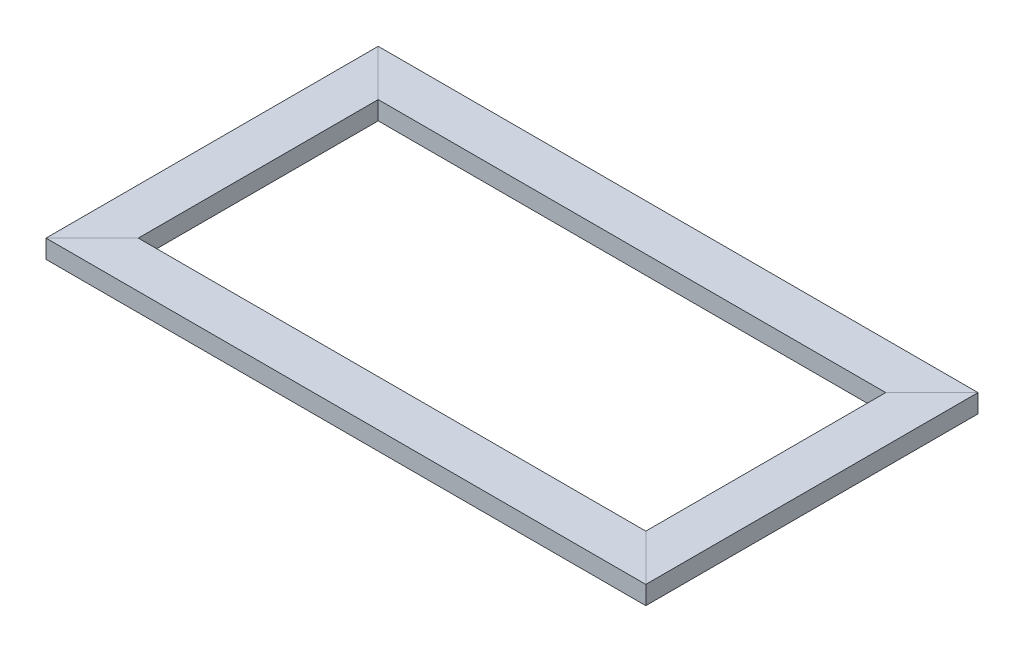
ISO-10303-21;
HEADER;
FILE_DESCRIPTION(('STEP AP214'),'2;1');
FILE_NAME('part.step','',(''),(''),'','','');
FILE_SCHEMA(('AUTOMOTIVE_DESIGN { 1 0 10303 214 1 1 1 1 }'));
ENDSEC;
DATA;
#1=APPLICATION_CONTEXT('core data for automotive mechanical design processes');
#2=APPLICATION_PROTOCOL_DEFINITION('international standard','automotive_design',2000,#1);
#3=PRODUCT_CONTEXT('',#1,'mechanical');
#4=PRODUCT('Part','Part','',(#3));
#5=PRODUCT_RELATED_PRODUCT_CATEGORY('part','',(#4));
#6=PRODUCT_DEFINITION_FORMATION('','',#4);
#7=PRODUCT_DEFINITION_CONTEXT('part definition',#1,'design');
#8=PRODUCT_DEFINITION('design','',#6,#7);
#9=PRODUCT_DEFINITION_SHAPE('','',#8);
#10=(LENGTH_UNIT() NAMED_UNIT(*) SI_UNIT(.MILLI.,.METRE.));
#11=(NAMED_UNIT(*) PLANE_ANGLE_UNIT() SI_UNIT($,.RADIAN.));
#12=(NAMED_UNIT(*) SI_UNIT($,.STERADIAN.) SOLID_ANGLE_UNIT());
#13=UNCERTAINTY_MEASURE_WITH_UNIT(LENGTH_MEASURE(1.E-05),#10,'distance_accuracy_value','');
#14=(GEOMETRIC_REPRESENTATION_CONTEXT(3) GLOBAL_UNCERTAINTY_ASSIGNED_CONTEXT((#13)) GLOBAL_UNIT_ASSIGNED_CONTEXT((#10,
#11,#12)) REPRESENTATION_CONTEXT('',''));
#15=CARTESIAN_POINT('',(0.,0.,0.));
#16=DIRECTION('',(0.,0.,1.));
#17=DIRECTION('',(1.,0.,0.));
#18=AXIS2_PLACEMENT_3D('',#15,#16,#17);
#19=CARTESIAN_POINT('',(650.,0.,-360.));
#20=DIRECTION('',(0.,0.,-1.));
#21=DIRECTION('',(0.,1.,0.));
#22=AXIS2_PLACEMENT_3D('',#19,#20,#21);
#23=PLANE('',#22);
#24=DIRECTION('',(-1.,0.,0.));
#25=VECTOR('',#24,1.);
#26=CARTESIAN_POINT('',(650.,0.,-360.));
#27=LINE('',#26,#25);
#28=CARTESIAN_POINT('',(650.,0.,-360.));
#29=VERTEX_POINT('',#28);
#30=CARTESIAN_POINT('',(0.,0.,-360.));
#31=VERTEX_POINT('',#30);
#32=EDGE_CURVE('E146',#29,#31,#27,.T.);
#33=ORIENTED_EDGE('',*,*,#32,.T.);
#34=DIRECTION('',(0.,-1.,0.));
#35=VECTOR('',#34,1.);
#36=CARTESIAN_POINT('',(1.66533453693773E-13,0.,-360.));
#37=LINE('',#36,#35);
#38=CARTESIAN_POINT('',(0.,20.,-360.));
#39=VERTEX_POINT('',#38);
#40=EDGE_CURVE('E140',#39,#31,#37,.T.);
#41=ORIENTED_EDGE('',*,*,#40,.F.);
#42=DIRECTION('',(-1.,0.,0.));
#43=VECTOR('',#42,1.);
#44=CARTESIAN_POINT('',(650.,20.,-360.));
#45=LINE('',#44,#43);
#46=CARTESIAN_POINT('',(650.,20.,-360.));
#47=VERTEX_POINT('',#46);
#48=EDGE_CURVE('E101',#47,#39,#45,.T.);
#49=ORIENTED_EDGE('',*,*,#48,.F.);
#50=DIRECTION('',(0.,-1.,0.));
#51=VECTOR('',#50,1.);
#52=CARTESIAN_POINT('',(650.,0.,-360.));
#53=LINE('',#52,#51);
#54=EDGE_CURVE('E170',#47,#29,#53,.T.);
#55=ORIENTED_EDGE('',*,*,#54,.T.);
#56=EDGE_LOOP('',(#33,#41,#49,#55));
#57=FACE_BOUND('',#56,.T.);
#58=ADVANCED_FACE('F39',(#57),#23,.T.);
#59=CARTESIAN_POINT('',(650.,0.,-310.));
#60=DIRECTION('',(0.,0.,1.));
#61=DIRECTION('',(0.,-1.,0.));
#62=AXIS2_PLACEMENT_3D('',#59,#60,#61);
#63=PLANE('',#62);
#64=DIRECTION('',(-1.,0.,0.));
#65=VECTOR('',#64,1.);
#66=CARTESIAN_POINT('',(650.,20.,-310.));
#67=LINE('',#66,#65);
#68=CARTESIAN_POINT('',(600.,20.,-310.));
#69=VERTEX_POINT('',#68);
#70=CARTESIAN_POINT('',(50.0000000000002,20.,-310.));
#71=VERTEX_POINT('',#70);
#72=EDGE_CURVE('E43',#69,#71,#67,.T.);
#73=ORIENTED_EDGE('',*,*,#72,.T.);
#74=DIRECTION('',(0.,-1.,0.));
#75=VECTOR('',#74,1.);
#76=CARTESIAN_POINT('',(50.0000000000002,0.,-310.));
#77=LINE('',#76,#75);
#78=CARTESIAN_POINT('',(50.0000000000002,0.,-310.));
#79=VERTEX_POINT('',#78);
#80=EDGE_CURVE('E108',#71,#79,#77,.T.);
#81=ORIENTED_EDGE('',*,*,#80,.T.);
#82=DIRECTION('',(-1.,0.,0.));
#83=VECTOR('',#82,1.);
#84=CARTESIAN_POINT('',(650.,0.,-310.));
#85=LINE('',#84,#83);
#86=CARTESIAN_POINT('',(600.,0.,-310.));
#87=VERTEX_POINT('',#86);
#88=EDGE_CURVE('E117',#87,#79,#85,.T.);
#89=ORIENTED_EDGE('',*,*,#88,.F.);
#90=DIRECTION('',(0.,-1.,0.));
#91=VECTOR('',#90,1.);
#92=CARTESIAN_POINT('',(600.,0.,-310.));
#93=LINE('',#92,#91);
#94=EDGE_CURVE('E115',#69,#87,#93,.T.);
#95=ORIENTED_EDGE('',*,*,#94,.F.);
#96=EDGE_LOOP('',(#73,#81,#89,#95));
#97=FACE_BOUND('',#96,.T.);
#98=ADVANCED_FACE('F112',(#97),#63,.T.);
#99=CARTESIAN_POINT('',(650.,20.,-360.));
#100=DIRECTION('',(0.,1.,0.));
#101=DIRECTION('',(0.,0.,1.));
#102=AXIS2_PLACEMENT_3D('',#99,#100,#101);
#103=PLANE('',#102);
#104=ORIENTED_EDGE('',*,*,#48,.T.);
#105=DIRECTION('',(0.707106781186548,0.,0.707106781186548));
#106=VECTOR('',#105,1.);
#107=CARTESIAN_POINT('',(1.68570504622113E-13,20.,-360.));
#108=LINE('',#107,#106);
#109=EDGE_CURVE('E96',#39,#71,#108,.T.);
#110=ORIENTED_EDGE('',*,*,#109,.T.);
#111=ORIENTED_EDGE('',*,*,#72,.F.);
#112=DIRECTION('',(-0.707106781186548,0.,0.707106781186548));
#113=VECTOR('',#112,1.);
#114=CARTESIAN_POINT('',(470.,20.,-180.));
#115=LINE('',#114,#113);
#116=EDGE_CURVE('E181',#47,#69,#115,.T.);
#117=ORIENTED_EDGE('',*,*,#116,.F.);
#118=EDGE_LOOP('',(#104,#110,#111,#117));
#119=FACE_BOUND('',#118,.T.);
#120=ADVANCED_FACE('F98',(#119),#103,.T.);
#121=CARTESIAN_POINT('',(650.,0.,-360.));
#122=DIRECTION('',(0.,-1.,0.));
#123=DIRECTION('',(0.,0.,-1.));
#124=AXIS2_PLACEMENT_3D('',#121,#122,#123);
#125=PLANE('',#124);
#126=ORIENTED_EDGE('',*,*,#88,.T.);
#127=DIRECTION('',(-0.707106781186548,0.,-0.707106781186548));
#128=VECTOR('',#127,1.);
#129=CARTESIAN_POINT('',(1.66533453693773E-13,0.,-360.));
#130=LINE('',#129,#128);
#131=EDGE_CURVE('E89',#79,#31,#130,.T.);
#132=ORIENTED_EDGE('',*,*,#131,.T.);
#133=ORIENTED_EDGE('',*,*,#32,.F.);
#134=DIRECTION('',(0.707106781186548,0.,-0.707106781186548));
#135=VECTOR('',#134,1.);
#136=CARTESIAN_POINT('',(470.,0.,-180.));
#137=LINE('',#136,#135);
#138=EDGE_CURVE('E107',#87,#29,#137,.T.);
#139=ORIENTED_EDGE('',*,*,#138,.F.);
#140=EDGE_LOOP('',(#126,#132,#133,#139));
#141=FACE_BOUND('',#140,.T.);
#142=ADVANCED_FACE('F41',(#141),#125,.T.);
#143=CARTESIAN_POINT('',(1.66533453693773E-13,0.,-360.));
#144=DIRECTION('',(-1.,0.,0.));
#145=DIRECTION('',(0.,-1.,0.));
#146=AXIS2_PLACEMENT_3D('',#143,#144,#145);
#147=PLANE('',#146);
#148=DIRECTION('',(0.,0.,1.));
#149=VECTOR('',#148,1.);
#150=CARTESIAN_POINT('',(1.66533453693773E-13,0.,-360.));
#151=LINE('',#150,#149);
#152=CARTESIAN_POINT('',(0.,0.,0.));
#153=VERTEX_POINT('',#152);
#154=EDGE_CURVE('E138',#31,#153,#151,.T.);
#155=ORIENTED_EDGE('',*,*,#154,.T.);
#156=DIRECTION('',(0.,-1.,0.));
#157=VECTOR('',#156,1.);
#158=CARTESIAN_POINT('',(0.,0.,0.));
#159=LINE('',#158,#157);
#160=CARTESIAN_POINT('',(0.,20.,0.));
#161=VERTEX_POINT('',#160);
#162=EDGE_CURVE('E220',#161,#153,#159,.T.);
#163=ORIENTED_EDGE('',*,*,#162,.F.);
#164=DIRECTION('',(0.,0.,1.));
#165=VECTOR('',#164,1.);
#166=CARTESIAN_POINT('',(1.68570504622113E-13,20.,-360.));
#167=LINE('',#166,#165);
#168=EDGE_CURVE('E134',#39,#161,#167,.T.);
#169=ORIENTED_EDGE('',*,*,#168,.F.);
#170=ORIENTED_EDGE('',*,*,#40,.T.);
#171=EDGE_LOOP('',(#155,#163,#169,#170));
#172=FACE_BOUND('',#171,.T.);
#173=ADVANCED_FACE('F164',(#172),#147,.T.);
#174=CARTESIAN_POINT('',(50.0000000000002,0.,-360.));
#175=DIRECTION('',(1.,0.,0.));
#176=DIRECTION('',(0.,1.,0.));
#177=AXIS2_PLACEMENT_3D('',#174,#175,#176);
#178=PLANE('',#177);
#179=DIRECTION('',(0.,0.,1.));
#180=VECTOR('',#179,1.);
#181=CARTESIAN_POINT('',(50.0000000000002,20.,-360.));
#182=LINE('',#181,#180);
#183=CARTESIAN_POINT('',(50.0000000000001,20.,-50.0000000000001));
#184=VERTEX_POINT('',#183);
#185=EDGE_CURVE('E123',#71,#184,#182,.T.);
#186=ORIENTED_EDGE('',*,*,#185,.T.);
#187=DIRECTION('',(0.,-1.,0.));
#188=VECTOR('',#187,1.);
#189=CARTESIAN_POINT('',(50.,0.,-50.));
#190=LINE('',#189,#188);
#191=CARTESIAN_POINT('',(50.0000000000001,0.,-50.0000000000001));
#192=VERTEX_POINT('',#191);
#193=EDGE_CURVE('E192',#184,#192,#190,.T.);
#194=ORIENTED_EDGE('',*,*,#193,.T.);
#195=DIRECTION('',(0.,0.,1.));
#196=VECTOR('',#195,1.);
#197=CARTESIAN_POINT('',(50.0000000000002,0.,-360.));
#198=LINE('',#197,#196);
#199=EDGE_CURVE('E126',#79,#192,#198,.T.);
#200=ORIENTED_EDGE('',*,*,#199,.F.);
#201=ORIENTED_EDGE('',*,*,#80,.F.);
#202=EDGE_LOOP('',(#186,#194,#200,#201));
#203=FACE_BOUND('',#202,.T.);
#204=ADVANCED_FACE('F121',(#203),#178,.T.);
#205=CARTESIAN_POINT('',(1.68570504622113E-13,20.,-360.));
#206=DIRECTION('',(0.,1.,0.));
#207=DIRECTION('',(-1.,0.,0.));
#208=AXIS2_PLACEMENT_3D('',#205,#206,#207);
#209=PLANE('',#208);
#210=ORIENTED_EDGE('',*,*,#168,.T.);
#211=DIRECTION('',(0.707106781186548,0.,-0.707106781186548));
#212=VECTOR('',#211,1.);
#213=CARTESIAN_POINT('',(0.,20.,0.));
#214=LINE('',#213,#212);
#215=EDGE_CURVE('E132',#161,#184,#214,.T.);
#216=ORIENTED_EDGE('',*,*,#215,.T.);
#217=ORIENTED_EDGE('',*,*,#185,.F.);
#218=ORIENTED_EDGE('',*,*,#109,.F.);
#219=EDGE_LOOP('',(#210,#216,#217,#218));
#220=FACE_BOUND('',#219,.T.);
#221=ADVANCED_FACE('F130',(#220),#209,.T.);
#222=CARTESIAN_POINT('',(1.66533453693773E-13,0.,-360.));
#223=DIRECTION('',(0.,-1.,0.));
#224=DIRECTION('',(1.,0.,0.));
#225=AXIS2_PLACEMENT_3D('',#222,#223,#224);
#226=PLANE('',#225);
#227=ORIENTED_EDGE('',*,*,#199,.T.);
#228=DIRECTION('',(-0.707106781186548,0.,0.707106781186548));
#229=VECTOR('',#228,1.);
#230=CARTESIAN_POINT('',(0.,0.,0.));
#231=LINE('',#230,#229);
#232=EDGE_CURVE('E222',#192,#153,#231,.T.);
#233=ORIENTED_EDGE('',*,*,#232,.T.);
#234=ORIENTED_EDGE('',*,*,#154,.F.);
#235=ORIENTED_EDGE('',*,*,#131,.F.);
#236=EDGE_LOOP('',(#227,#233,#234,#235));
#237=FACE_BOUND('',#236,.T.);
#238=ADVANCED_FACE('F152',(#237),#226,.T.);
#239=CARTESIAN_POINT('',(650.,0.,0.));
#240=DIRECTION('',(1.,0.,0.));
#241=DIRECTION('',(0.,1.,0.));
#242=AXIS2_PLACEMENT_3D('',#239,#240,#241);
#243=PLANE('',#242);
#244=DIRECTION('',(0.,0.,-1.));
#245=VECTOR('',#244,1.);
#246=CARTESIAN_POINT('',(650.,0.,0.));
#247=LINE('',#246,#245);
#248=CARTESIAN_POINT('',(650.,0.,0.));
#249=VERTEX_POINT('',#248);
#250=EDGE_CURVE('E177',#249,#29,#247,.T.);
#251=ORIENTED_EDGE('',*,*,#250,.T.);
#252=ORIENTED_EDGE('',*,*,#54,.F.);
#253=DIRECTION('',(0.,0.,-1.));
#254=VECTOR('',#253,1.);
#255=CARTESIAN_POINT('',(650.,20.,0.));
#256=LINE('',#255,#254);
#257=CARTESIAN_POINT('',(650.,20.,0.));
#258=VERTEX_POINT('',#257);
#259=EDGE_CURVE('E194',#258,#47,#256,.T.);
#260=ORIENTED_EDGE('',*,*,#259,.F.);
#261=DIRECTION('',(0.,-1.,0.));
#262=VECTOR('',#261,1.);
#263=CARTESIAN_POINT('',(650.,0.,0.));
#264=LINE('',#263,#262);
#265=EDGE_CURVE('E187',#258,#249,#264,.T.);
#266=ORIENTED_EDGE('',*,*,#265,.T.);
#267=EDGE_LOOP('',(#251,#252,#260,#266));
#268=FACE_BOUND('',#267,.T.);
#269=ADVANCED_FACE('F185',(#268),#243,.T.);
#270=CARTESIAN_POINT('',(600.,0.,0.));
#271=DIRECTION('',(-1.,0.,0.));
#272=DIRECTION('',(0.,-1.,0.));
#273=AXIS2_PLACEMENT_3D('',#270,#271,#272);
#274=PLANE('',#273);
#275=DIRECTION('',(0.,0.,-1.));
#276=VECTOR('',#275,1.);
#277=CARTESIAN_POINT('',(600.,20.,0.));
#278=LINE('',#277,#276);
#279=CARTESIAN_POINT('',(600.,20.,-50.0000000000001));
#280=VERTEX_POINT('',#279);
#281=EDGE_CURVE('E204',#280,#69,#278,.T.);
#282=ORIENTED_EDGE('',*,*,#281,.T.);
#283=ORIENTED_EDGE('',*,*,#94,.T.);
#284=DIRECTION('',(0.,0.,-1.));
#285=VECTOR('',#284,1.);
#286=CARTESIAN_POINT('',(600.,0.,0.));
#287=LINE('',#286,#285);
#288=CARTESIAN_POINT('',(600.,0.,-50.0000000000001));
#289=VERTEX_POINT('',#288);
#290=EDGE_CURVE('E179',#289,#87,#287,.T.);
#291=ORIENTED_EDGE('',*,*,#290,.F.);
#292=DIRECTION('',(0.,-1.,0.));
#293=VECTOR('',#292,1.);
#294=CARTESIAN_POINT('',(600.,0.,-50.));
#295=LINE('',#294,#293);
#296=EDGE_CURVE('E230',#280,#289,#295,.T.);
#297=ORIENTED_EDGE('',*,*,#296,.F.);
#298=EDGE_LOOP('',(#282,#283,#291,#297));
#299=FACE_BOUND('',#298,.T.);
#300=ADVANCED_FACE('F278',(#299),#274,.T.);
#301=CARTESIAN_POINT('',(650.,20.,0.));
#302=DIRECTION('',(0.,1.,0.));
#303=DIRECTION('',(0.,0.,1.));
#304=AXIS2_PLACEMENT_3D('',#301,#302,#303);
#305=PLANE('',#304);
#306=ORIENTED_EDGE('',*,*,#259,.T.);
#307=ORIENTED_EDGE('',*,*,#116,.T.);
#308=ORIENTED_EDGE('',*,*,#281,.F.);
#309=DIRECTION('',(-0.707106781186548,0.,-0.707106781186548));
#310=VECTOR('',#309,1.);
#311=CARTESIAN_POINT('',(325.,20.,-325.));
#312=LINE('',#311,#310);
#313=EDGE_CURVE('E50',#258,#280,#312,.T.);
#314=ORIENTED_EDGE('',*,*,#313,.F.);
#315=EDGE_LOOP('',(#306,#307,#308,#314));
#316=FACE_BOUND('',#315,.T.);
#317=ADVANCED_FACE('F267',(#316),#305,.T.);
#318=CARTESIAN_POINT('',(650.,0.,0.));
#319=DIRECTION('',(0.,-1.,0.));
#320=DIRECTION('',(0.,0.,-1.));
#321=AXIS2_PLACEMENT_3D('',#318,#319,#320);
#322=PLANE('',#321);
#323=ORIENTED_EDGE('',*,*,#290,.T.);
#324=ORIENTED_EDGE('',*,*,#138,.T.);
#325=ORIENTED_EDGE('',*,*,#250,.F.);
#326=DIRECTION('',(0.707106781186548,0.,0.707106781186548));
#327=VECTOR('',#326,1.);
#328=CARTESIAN_POINT('',(325.,0.,-325.));
#329=LINE('',#328,#327);
#330=EDGE_CURVE('E11',#289,#249,#329,.T.);
#331=ORIENTED_EDGE('',*,*,#330,.F.);
#332=EDGE_LOOP('',(#323,#324,#325,#331));
#333=FACE_BOUND('',#332,.T.);
#334=ADVANCED_FACE('F175',(#333),#322,.T.);
#335=CARTESIAN_POINT('',(0.,0.,0.));
#336=DIRECTION('',(0.,0.,1.));
#337=DIRECTION('',(1.,0.,0.));
#338=AXIS2_PLACEMENT_3D('',#335,#336,#337);
#339=PLANE('',#338);
#340=DIRECTION('',(1.,0.,0.));
#341=VECTOR('',#340,1.);
#342=CARTESIAN_POINT('',(0.,0.,0.));
#343=LINE('',#342,#341);
#344=EDGE_CURVE('E226',#153,#249,#343,.T.);
#345=ORIENTED_EDGE('',*,*,#344,.T.);
#346=ORIENTED_EDGE('',*,*,#265,.F.);
#347=DIRECTION('',(1.,0.,0.));
#348=VECTOR('',#347,1.);
#349=CARTESIAN_POINT('',(0.,20.,0.));
#350=LINE('',#349,#348);
#351=EDGE_CURVE('E215',#161,#258,#350,.T.);
#352=ORIENTED_EDGE('',*,*,#351,.F.);
#353=ORIENTED_EDGE('',*,*,#162,.T.);
#354=EDGE_LOOP('',(#345,#346,#352,#353));
#355=FACE_BOUND('',#354,.T.);
#356=ADVANCED_FACE('F259',(#355),#339,.T.);
#357=CARTESIAN_POINT('',(0.,0.,-50.));
#358=DIRECTION('',(0.,0.,-1.));
#359=DIRECTION('',(-1.,0.,0.));
#360=AXIS2_PLACEMENT_3D('',#357,#358,#359);
#361=PLANE('',#360);
#362=ORIENTED_EDGE('',*,*,#193,.F.);
#363=DIRECTION('',(1.,0.,0.));
#364=VECTOR('',#363,1.);
#365=CARTESIAN_POINT('',(0.,20.,-50.));
#366=LINE('',#365,#364);
#367=EDGE_CURVE('E211',#184,#280,#366,.T.);
#368=ORIENTED_EDGE('',*,*,#367,.T.);
#369=ORIENTED_EDGE('',*,*,#296,.T.);
#370=DIRECTION('',(1.,0.,0.));
#371=VECTOR('',#370,1.);
#372=CARTESIAN_POINT('',(0.,0.,-50.));
#373=LINE('',#372,#371);
#374=EDGE_CURVE('E216',#192,#289,#373,.T.);
#375=ORIENTED_EDGE('',*,*,#374,.F.);
#376=EDGE_LOOP('',(#362,#368,#369,#375));
#377=FACE_BOUND('',#376,.T.);
#378=ADVANCED_FACE('F244',(#377),#361,.T.);
#379=CARTESIAN_POINT('',(0.,20.,0.));
#380=DIRECTION('',(0.,1.,0.));
#381=DIRECTION('',(-1.,0.,0.));
#382=AXIS2_PLACEMENT_3D('',#379,#380,#381);
#383=PLANE('',#382);
#384=ORIENTED_EDGE('',*,*,#215,.F.);
#385=ORIENTED_EDGE('',*,*,#351,.T.);
#386=ORIENTED_EDGE('',*,*,#313,.T.);
#387=ORIENTED_EDGE('',*,*,#367,.F.);
#388=EDGE_LOOP('',(#384,#385,#386,#387));
#389=FACE_BOUND('',#388,.T.);
#390=ADVANCED_FACE('F258',(#389),#383,.T.);
#391=CARTESIAN_POINT('',(0.,0.,0.));
#392=DIRECTION('',(0.,-1.,0.));
#393=DIRECTION('',(1.,0.,0.));
#394=AXIS2_PLACEMENT_3D('',#391,#392,#393);
#395=PLANE('',#394);
#396=ORIENTED_EDGE('',*,*,#232,.F.);
#397=ORIENTED_EDGE('',*,*,#374,.T.);
#398=ORIENTED_EDGE('',*,*,#330,.T.);
#399=ORIENTED_EDGE('',*,*,#344,.F.);
#400=EDGE_LOOP('',(#396,#397,#398,#399));
#401=FACE_BOUND('',#400,.T.);
#402=ADVANCED_FACE('F247',(#401),#395,.T.);
#403=CLOSED_SHELL('',(#58,#98,#120,#142,#173,#204,#221,#238,#269,#300,#317,#334,#356,#378,#390,#402));
#404=MANIFOLD_SOLID_BREP('B2',#403);
#405=ADVANCED_BREP_SHAPE_REPRESENTATION('',(#18,#404),#14);
#406=SHAPE_DEFINITION_REPRESENTATION(#9,#405);
ENDSEC;
END-ISO-10303-21;
